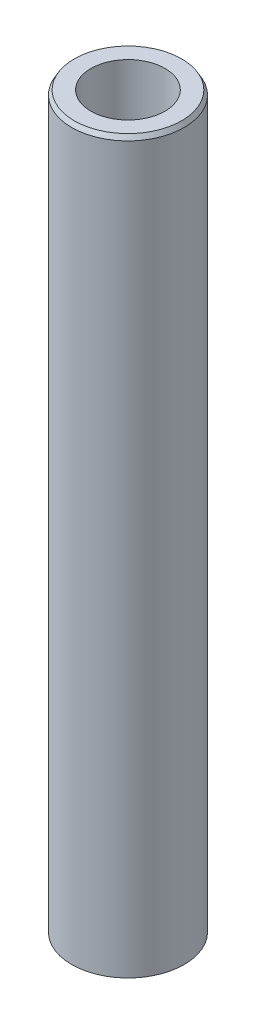
ISO-10303-21;
HEADER;
FILE_DESCRIPTION(('STEP AP214'),'2;1');
FILE_NAME('part.step','',(''),(''),'','','');
FILE_SCHEMA(('AUTOMOTIVE_DESIGN { 1 0 10303 214 1 1 1 1 }'));
ENDSEC;
DATA;
#1=APPLICATION_CONTEXT('core data for automotive mechanical design processes');
#2=APPLICATION_PROTOCOL_DEFINITION('international standard','automotive_design',2000,#1);
#3=PRODUCT_CONTEXT('',#1,'mechanical');
#4=PRODUCT('Part','Part','',(#3));
#5=PRODUCT_RELATED_PRODUCT_CATEGORY('part','',(#4));
#6=PRODUCT_DEFINITION_FORMATION('','',#4);
#7=PRODUCT_DEFINITION_CONTEXT('part definition',#1,'design');
#8=PRODUCT_DEFINITION('design','',#6,#7);
#9=PRODUCT_DEFINITION_SHAPE('','',#8);
#10=(LENGTH_UNIT() NAMED_UNIT(*) SI_UNIT(.MILLI.,.METRE.));
#11=(NAMED_UNIT(*) PLANE_ANGLE_UNIT() SI_UNIT($,.RADIAN.));
#12=(NAMED_UNIT(*) SI_UNIT($,.STERADIAN.) SOLID_ANGLE_UNIT());
#13=UNCERTAINTY_MEASURE_WITH_UNIT(LENGTH_MEASURE(1.E-05),#10,'distance_accuracy_value','');
#14=(GEOMETRIC_REPRESENTATION_CONTEXT(3) GLOBAL_UNCERTAINTY_ASSIGNED_CONTEXT((#13)) GLOBAL_UNIT_ASSIGNED_CONTEXT((#10,
#11,#12)) REPRESENTATION_CONTEXT('',''));
#15=CARTESIAN_POINT('',(0.,0.,0.));
#16=DIRECTION('',(0.,0.,1.));
#17=DIRECTION('',(1.,0.,0.));
#18=AXIS2_PLACEMENT_3D('',#15,#16,#17);
#19=CARTESIAN_POINT('',(0.,227.662841823562,0.));
#20=DIRECTION('',(0.,-1.,0.));
#21=DIRECTION('',(0.,0.,-1.));
#22=AXIS2_PLACEMENT_3D('',#19,#20,#21);
#23=CYLINDRICAL_SURFACE('',#22,17.5);
#24=CARTESIAN_POINT('',(0.,226.260288429432,0.));
#25=DIRECTION('',(0.,1.,0.));
#26=DIRECTION('',(0.,0.,1.));
#27=AXIS2_PLACEMENT_3D('',#24,#25,#26);
#28=CIRCLE('',#27,17.5);
#29=CARTESIAN_POINT('',(0.,226.260288429432,17.5));
#30=VERTEX_POINT('',#29);
#31=EDGE_CURVE('E50',#30,#30,#28,.F.);
#32=ORIENTED_EDGE('',*,*,#31,.T.);
#33=EDGE_LOOP('',(#32));
#34=FACE_BOUND('',#33,.T.);
#35=CARTESIAN_POINT('',(0.,0.809764579653982,0.));
#36=DIRECTION('',(0.,1.,0.));
#37=DIRECTION('',(0.,0.,1.));
#38=AXIS2_PLACEMENT_3D('',#35,#36,#37);
#39=CIRCLE('',#38,17.5);
#40=CARTESIAN_POINT('',(0.,0.809764579653982,17.5));
#41=VERTEX_POINT('',#40);
#42=EDGE_CURVE('E51',#41,#41,#39,.T.);
#43=ORIENTED_EDGE('',*,*,#42,.T.);
#44=EDGE_LOOP('',(#43));
#45=FACE_BOUND('',#44,.T.);
#46=ADVANCED_FACE('F39',(#34,#45),#23,.T.);
#47=CARTESIAN_POINT('',(0.,227.662841823562,0.));
#48=DIRECTION('',(0.,1.,0.));
#49=DIRECTION('',(0.,0.,1.));
#50=AXIS2_PLACEMENT_3D('',#47,#48,#49);
#51=PLANE('',#50);
#52=CARTESIAN_POINT('',(0.,227.662841823562,0.));
#53=DIRECTION('',(0.,1.,0.));
#54=DIRECTION('',(0.,0.,1.));
#55=AXIS2_PLACEMENT_3D('',#52,#53,#54);
#56=CIRCLE('',#55,16.6902354203461);
#57=CARTESIAN_POINT('',(0.,227.662841823562,16.6902354203461));
#58=VERTEX_POINT('',#57);
#59=EDGE_CURVE('E54',#58,#58,#56,.T.);
#60=ORIENTED_EDGE('',*,*,#59,.T.);
#61=EDGE_LOOP('',(#60));
#62=FACE_BOUND('',#61,.T.);
#63=CARTESIAN_POINT('',(0.,227.662841823562,0.));
#64=DIRECTION('',(0.,1.,0.));
#65=DIRECTION('',(0.,0.,1.));
#66=AXIS2_PLACEMENT_3D('',#63,#64,#65);
#67=CIRCLE('',#66,11.5244013940322);
#68=CARTESIAN_POINT('',(0.,227.662841823562,11.5244013940322));
#69=VERTEX_POINT('',#68);
#70=EDGE_CURVE('E58',#69,#69,#67,.T.);
#71=ORIENTED_EDGE('',*,*,#70,.F.);
#72=EDGE_LOOP('',(#71));
#73=FACE_BOUND('',#72,.T.);
#74=ADVANCED_FACE('F69',(#62,#73),#51,.T.);
#75=CARTESIAN_POINT('',(0.,0.,0.));
#76=DIRECTION('',(0.,1.,0.));
#77=DIRECTION('',(0.,0.,1.));
#78=AXIS2_PLACEMENT_3D('',#75,#76,#77);
#79=PLANE('',#78);
#80=CARTESIAN_POINT('',(0.,0.,0.));
#81=DIRECTION('',(0.,1.,0.));
#82=DIRECTION('',(0.,0.,1.));
#83=AXIS2_PLACEMENT_3D('',#80,#81,#82);
#84=CIRCLE('',#83,16.0974466058696);
#85=CARTESIAN_POINT('',(0.,0.,16.0974466058696));
#86=VERTEX_POINT('',#85);
#87=EDGE_CURVE('E10',#86,#86,#84,.F.);
#88=ORIENTED_EDGE('',*,*,#87,.T.);
#89=EDGE_LOOP('',(#88));
#90=FACE_BOUND('',#89,.T.);
#91=CARTESIAN_POINT('',(0.,0.,0.));
#92=DIRECTION('',(0.,1.,0.));
#93=DIRECTION('',(0.,0.,1.));
#94=AXIS2_PLACEMENT_3D('',#91,#92,#93);
#95=CIRCLE('',#94,11.5244013940322);
#96=CARTESIAN_POINT('',(0.,0.,11.5244013940322));
#97=VERTEX_POINT('',#96);
#98=EDGE_CURVE('E63',#97,#97,#95,.T.);
#99=ORIENTED_EDGE('',*,*,#98,.T.);
#100=EDGE_LOOP('',(#99));
#101=FACE_BOUND('',#100,.T.);
#102=ADVANCED_FACE('F75',(#90,#101),#79,.F.);
#103=CARTESIAN_POINT('',(0.,227.662841823562,0.));
#104=DIRECTION('',(0.,-1.,0.));
#105=DIRECTION('',(0.,0.,-1.));
#106=AXIS2_PLACEMENT_3D('',#103,#104,#105);
#107=CYLINDRICAL_SURFACE('',#106,11.5244013940322);
#108=ORIENTED_EDGE('',*,*,#70,.T.);
#109=EDGE_LOOP('',(#108));
#110=FACE_BOUND('',#109,.T.);
#111=ORIENTED_EDGE('',*,*,#98,.F.);
#112=EDGE_LOOP('',(#111));
#113=FACE_BOUND('',#112,.T.);
#114=ADVANCED_FACE('F70',(#110,#113),#107,.F.);
#115=CARTESIAN_POINT('',(0.,227.662841823562,0.));
#116=DIRECTION('',(0.,-1.,0.));
#117=DIRECTION('',(0.,0.,-1.));
#118=AXIS2_PLACEMENT_3D('',#115,#116,#117);
#119=CONICAL_SURFACE('',#118,16.6902354203461,0.523598775598283);
#120=ORIENTED_EDGE('',*,*,#31,.F.);
#121=EDGE_LOOP('',(#120));
#122=FACE_BOUND('',#121,.T.);
#123=ORIENTED_EDGE('',*,*,#59,.F.);
#124=EDGE_LOOP('',(#123));
#125=FACE_BOUND('',#124,.T.);
#126=ADVANCED_FACE('F81',(#122,#125),#119,.T.);
#127=CARTESIAN_POINT('',(0.,0.809764579653982,0.));
#128=DIRECTION('',(0.,1.,0.));
#129=DIRECTION('',(0.,0.,1.));
#130=AXIS2_PLACEMENT_3D('',#127,#128,#129);
#131=CONICAL_SURFACE('',#130,17.5,1.0471975511966);
#132=CARTESIAN_POINT('',(0.,0.,16.0974466058696));
#133=CARTESIAN_POINT('',(0.,0.00843504770472969,16.1120565370585));
#134=CARTESIAN_POINT('',(0.,0.0168700954094584,16.1266664682474));
#135=CARTESIAN_POINT('',(0.,0.0337401908189158,16.1558863306251));
#136=CARTESIAN_POINT('',(0.,0.0421752385236445,16.1704962618139));
#137=CARTESIAN_POINT('',(0.,0.0590453339331026,16.1997161241917));
#138=CARTESIAN_POINT('',(0.,0.067480381637832,16.2143260553805));
#139=CARTESIAN_POINT('',(0.,0.08435047704729,16.2435459177582));
#140=CARTESIAN_POINT('',(0.,0.0927855247520185,16.2581558489471));
#141=CARTESIAN_POINT('',(0.,0.109655620161476,16.2873757113248));
#142=CARTESIAN_POINT('',(0.,0.118090667866205,16.3019856425137));
#143=CARTESIAN_POINT('',(0.,0.134960763275664,16.3312055048914));
#144=CARTESIAN_POINT('',(0.,0.143395810980393,16.3458154360802));
#145=CARTESIAN_POINT('',(0.,0.160265906389851,16.3750352984579));
#146=CARTESIAN_POINT('',(0.,0.168700954094579,16.3896452296468));
#147=CARTESIAN_POINT('',(0.,0.185571049504037,16.4188650920245));
#148=CARTESIAN_POINT('',(0.,0.194006097208767,16.4334750232134));
#149=CARTESIAN_POINT('',(0.,0.210876192618225,16.4626948855911));
#150=CARTESIAN_POINT('',(0.,0.219311240322953,16.47730481678));
#151=CARTESIAN_POINT('',(0.,0.236181335732411,16.5065246791577));
#152=CARTESIAN_POINT('',(0.,0.24461638343714,16.5211346103465));
#153=CARTESIAN_POINT('',(0.,0.261486478846598,16.5503544727242));
#154=CARTESIAN_POINT('',(0.,0.269921526551328,16.5649644039131));
#155=CARTESIAN_POINT('',(0.,0.286791621960785,16.5941842662908));
#156=CARTESIAN_POINT('',(0.,0.295226669665514,16.6087941974797));
#157=CARTESIAN_POINT('',(0.,0.312096765074972,16.6380140598574));
#158=CARTESIAN_POINT('',(0.,0.320531812779701,16.6526239910462));
#159=CARTESIAN_POINT('',(0.,0.337401908189159,16.681843853424));
#160=CARTESIAN_POINT('',(0.,0.345836955893888,16.6964537846128));
#161=CARTESIAN_POINT('',(0.,0.362707051303346,16.7256736469905));
#162=CARTESIAN_POINT('',(0.,0.371142099008075,16.7402835781794));
#163=CARTESIAN_POINT('',(0.,0.388012194417533,16.7695034405571));
#164=CARTESIAN_POINT('',(0.,0.396447242122262,16.784113371746));
#165=CARTESIAN_POINT('',(0.,0.41331733753172,16.8133332341237));
#166=CARTESIAN_POINT('',(0.,0.421752385236449,16.8279431653125));
#167=CARTESIAN_POINT('',(0.,0.438622480645907,16.8571630276903));
#168=CARTESIAN_POINT('',(0.,0.447057528350636,16.8717729588791));
#169=CARTESIAN_POINT('',(0.,0.463927623760094,16.9009928212568));
#170=CARTESIAN_POINT('',(0.,0.472362671464823,16.9156027524457));
#171=CARTESIAN_POINT('',(0.,0.48923276687428,16.9448226148234));
#172=CARTESIAN_POINT('',(0.,0.49766781457901,16.9594325460123));
#173=CARTESIAN_POINT('',(0.,0.514537909988468,16.98865240839));
#174=CARTESIAN_POINT('',(0.,0.522972957693197,17.0032623395788));
#175=CARTESIAN_POINT('',(0.,0.539843053102655,17.0324822019566));
#176=CARTESIAN_POINT('',(0.,0.548278100807383,17.0470921331454));
#177=CARTESIAN_POINT('',(0.,0.565148196216841,17.0763119955231));
#178=CARTESIAN_POINT('',(0.,0.573583243921571,17.090921926712));
#179=CARTESIAN_POINT('',(0.,0.590453339331029,17.1201417890897));
#180=CARTESIAN_POINT('',(0.,0.598888387035757,17.1347517202786));
#181=CARTESIAN_POINT('',(0.,0.615758482445215,17.1639715826563));
#182=CARTESIAN_POINT('',(0.,0.624193530149945,17.1785815138451));
#183=CARTESIAN_POINT('',(0.,0.641063625559403,17.2078013762228));
#184=CARTESIAN_POINT('',(0.,0.649498673264131,17.2224113074117));
#185=CARTESIAN_POINT('',(0.,0.666368768673589,17.2516311697894));
#186=CARTESIAN_POINT('',(0.,0.674803816378318,17.2662411009783));
#187=CARTESIAN_POINT('',(0.,0.691673911787776,17.295460963356));
#188=CARTESIAN_POINT('',(0.,0.700108959492506,17.3100708945449));
#189=CARTESIAN_POINT('',(0.,0.716979054901963,17.3392907569226));
#190=CARTESIAN_POINT('',(0.,0.725414102606692,17.3539006881114));
#191=CARTESIAN_POINT('',(0.,0.74228419801615,17.3831205504891));
#192=CARTESIAN_POINT('',(0.,0.750719245720879,17.397730481678));
#193=CARTESIAN_POINT('',(0.,0.767589341130337,17.4269503440557));
#194=CARTESIAN_POINT('',(0.,0.776024388835066,17.4415602752446));
#195=CARTESIAN_POINT('',(0.,0.792894484244523,17.4707801376223));
#196=CARTESIAN_POINT('',(0.,0.801329531949252,17.4853900688111));
#197=CARTESIAN_POINT('',(0.,0.809764579653982,17.5));
#198=B_SPLINE_CURVE_WITH_KNOTS('',3,(#132,#133,#134,#135,#136,#137,#138,#139,#140,#141,#142,
#143,#144,#145,#146,#147,#148,#149,#150,#151,#152,#153,#154,#155,#156,#157,#158,#159,#160,#161,
#162,#163,#164,#165,#166,#167,#168,#169,#170,#171,#172,#173,#174,#175,#176,#177,#178,#179,#180,
#181,#182,#183,#184,#185,#186,#187,#188,#189,#190,#191,#192,#193,#194,#195,#196,#197),
.UNSPECIFIED.,.F.,.F.,(4,2,2,2,2,2,2,2,2,2,2,2,2,2,2,2,2,2,2,2,2,2,2,2,2,2,2,2,2,2,2,2,4),(0.,
0.0506102862283728,0.101220572456749,0.151830858685121,0.202441144913497,0.25305143114187,
0.303661717370243,0.354272003598619,0.404882289826991,0.455492576055367,0.50610286228374,
0.556713148512113,0.607323434740489,0.657933720968861,0.708544007197237,0.75915429342561,
0.809764579653983,0.860374865882359,0.910985152110732,0.961595438339107,1.01220572456748,
1.06281601079585,1.11342629702423,1.1640365832526,1.21464686948098,1.26525715570935,
1.31586744193773,1.3664777281661,1.41708801439447,1.46769830062285,1.51830858685122,
1.5689188730796,1.61952915930797),.UNSPECIFIED.);
#199=EDGE_CURVE('BSEAM45',#86,#41,#198,.T.);
#200=ORIENTED_EDGE('',*,*,#87,.F.);
#201=ORIENTED_EDGE('',*,*,#42,.F.);
#202=ORIENTED_EDGE('',*,*,#199,.T.);
#203=ORIENTED_EDGE('',*,*,#199,.F.);
#204=EDGE_LOOP('',(#200,#202,#201,#203));
#205=FACE_BOUND('',#204,.T.);
#206=ADVANCED_FACE('F45',(#205),#131,.T.);
#207=CLOSED_SHELL('',(#46,#74,#102,#114,#126,#206));
#208=MANIFOLD_SOLID_BREP('B2',#207);
#209=ADVANCED_BREP_SHAPE_REPRESENTATION('',(#18,#208),#14);
#210=SHAPE_DEFINITION_REPRESENTATION(#9,#209);
ENDSEC;
END-ISO-10303-21;
